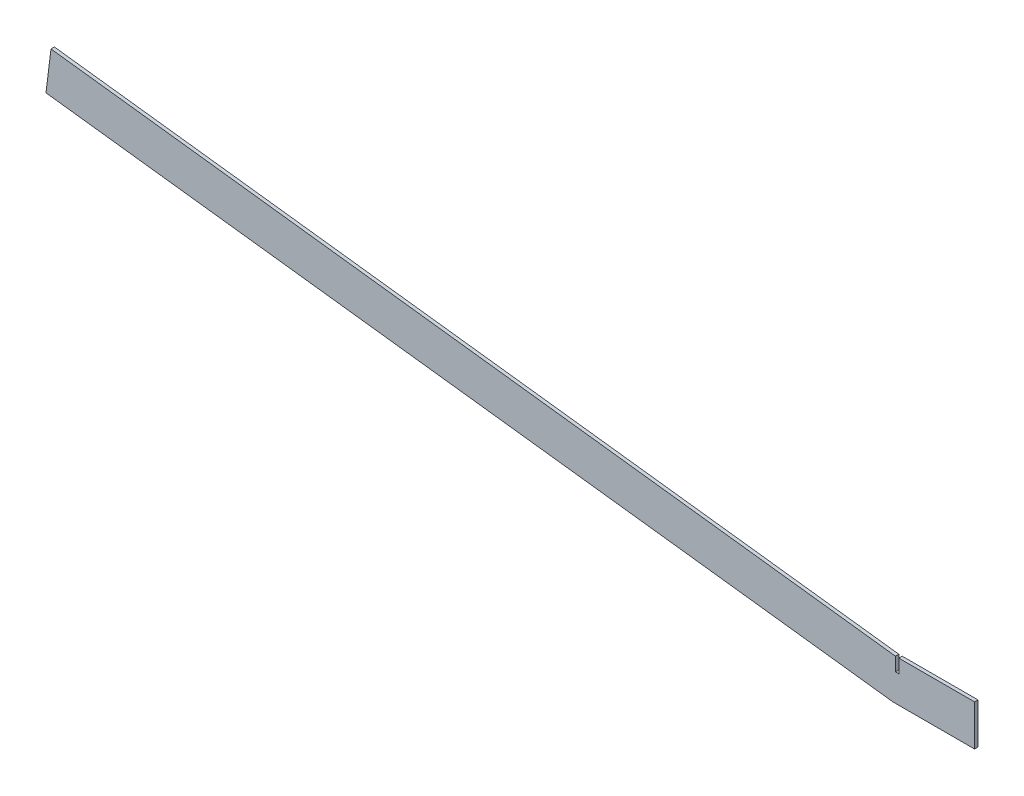
ISO-10303-21;
HEADER;
FILE_DESCRIPTION(('STEP AP214'),'2;1');
FILE_NAME('part.step','',(''),(''),'','','');
FILE_SCHEMA(('AUTOMOTIVE_DESIGN { 1 0 10303 214 1 1 1 1 }'));
ENDSEC;
DATA;
#1=APPLICATION_CONTEXT('core data for automotive mechanical design processes');
#2=APPLICATION_PROTOCOL_DEFINITION('international standard','automotive_design',2000,#1);
#3=PRODUCT_CONTEXT('',#1,'mechanical');
#4=PRODUCT('Part','Part','',(#3));
#5=PRODUCT_RELATED_PRODUCT_CATEGORY('part','',(#4));
#6=PRODUCT_DEFINITION_FORMATION('','',#4);
#7=PRODUCT_DEFINITION_CONTEXT('part definition',#1,'design');
#8=PRODUCT_DEFINITION('design','',#6,#7);
#9=PRODUCT_DEFINITION_SHAPE('','',#8);
#10=(LENGTH_UNIT() NAMED_UNIT(*) SI_UNIT(.MILLI.,.METRE.));
#11=(NAMED_UNIT(*) PLANE_ANGLE_UNIT() SI_UNIT($,.RADIAN.));
#12=(NAMED_UNIT(*) SI_UNIT($,.STERADIAN.) SOLID_ANGLE_UNIT());
#13=UNCERTAINTY_MEASURE_WITH_UNIT(LENGTH_MEASURE(1.E-05),#10,'distance_accuracy_value','');
#14=(GEOMETRIC_REPRESENTATION_CONTEXT(3) GLOBAL_UNCERTAINTY_ASSIGNED_CONTEXT((#13)) GLOBAL_UNIT_ASSIGNED_CONTEXT((#10,
#11,#12)) REPRESENTATION_CONTEXT('',''));
#15=CARTESIAN_POINT('',(0.,0.,0.));
#16=DIRECTION('',(0.,0.,1.));
#17=DIRECTION('',(1.,0.,0.));
#18=AXIS2_PLACEMENT_3D('',#15,#16,#17);
#19=CARTESIAN_POINT('',(5.50529582773423,0.,1.5875));
#20=DIRECTION('',(-1.,0.,0.));
#21=DIRECTION('',(0.,0.,1.));
#22=AXIS2_PLACEMENT_3D('',#19,#20,#21);
#23=PLANE('',#22);
#24=DIRECTION('',(0.,1.,0.));
#25=VECTOR('',#24,1.);
#26=CARTESIAN_POINT('',(5.50529582773423,0.,-1.5875));
#27=LINE('',#26,#25);
#28=CARTESIAN_POINT('',(5.50529582773423,25.4,-1.5875));
#29=VERTEX_POINT('',#28);
#30=CARTESIAN_POINT('',(5.50529582773423,38.1,-1.5875));
#31=VERTEX_POINT('',#30);
#32=EDGE_CURVE('E145',#29,#31,#27,.T.);
#33=ORIENTED_EDGE('',*,*,#32,.F.);
#34=DIRECTION('',(0.,0.,-1.));
#35=VECTOR('',#34,1.);
#36=CARTESIAN_POINT('',(5.50529582773423,25.4,1.5875));
#37=LINE('',#36,#35);
#38=CARTESIAN_POINT('',(5.50529582773423,25.4,1.5875));
#39=VERTEX_POINT('',#38);
#40=EDGE_CURVE('E11',#39,#29,#37,.T.);
#41=ORIENTED_EDGE('',*,*,#40,.F.);
#42=DIRECTION('',(0.,1.,0.));
#43=VECTOR('',#42,1.);
#44=CARTESIAN_POINT('',(5.50529582773423,0.,1.5875));
#45=LINE('',#44,#43);
#46=CARTESIAN_POINT('',(5.50529582773423,38.1,1.5875));
#47=VERTEX_POINT('',#46);
#48=EDGE_CURVE('E177',#39,#47,#45,.T.);
#49=ORIENTED_EDGE('',*,*,#48,.T.);
#50=DIRECTION('',(0.,0.,-1.));
#51=VECTOR('',#50,1.);
#52=CARTESIAN_POINT('',(5.50529582773423,38.1,1.5875));
#53=LINE('',#52,#51);
#54=EDGE_CURVE('E58',#47,#31,#53,.T.);
#55=ORIENTED_EDGE('',*,*,#54,.T.);
#56=EDGE_LOOP('',(#33,#41,#49,#55));
#57=FACE_BOUND('',#56,.T.);
#58=ADVANCED_FACE('F41',(#57),#23,.T.);
#59=CARTESIAN_POINT('',(0.,25.4,1.5875));
#60=DIRECTION('',(0.,1.,0.));
#61=DIRECTION('',(0.,0.,1.));
#62=AXIS2_PLACEMENT_3D('',#59,#60,#61);
#63=PLANE('',#62);
#64=DIRECTION('',(1.,0.,0.));
#65=VECTOR('',#64,1.);
#66=CARTESIAN_POINT('',(0.,25.4,-1.5875));
#67=LINE('',#66,#65);
#68=CARTESIAN_POINT('',(2.33029582773423,25.4,-1.5875));
#69=VERTEX_POINT('',#68);
#70=EDGE_CURVE('E148',#69,#29,#67,.T.);
#71=ORIENTED_EDGE('',*,*,#70,.F.);
#72=DIRECTION('',(0.,0.,-1.));
#73=VECTOR('',#72,1.);
#74=CARTESIAN_POINT('',(2.33029582773423,25.4,1.5875));
#75=LINE('',#74,#73);
#76=CARTESIAN_POINT('',(2.33029582773423,25.4,1.5875));
#77=VERTEX_POINT('',#76);
#78=EDGE_CURVE('E50',#77,#69,#75,.T.);
#79=ORIENTED_EDGE('',*,*,#78,.F.);
#80=DIRECTION('',(1.,0.,0.));
#81=VECTOR('',#80,1.);
#82=CARTESIAN_POINT('',(0.,25.4,1.5875));
#83=LINE('',#82,#81);
#84=EDGE_CURVE('E214',#77,#39,#83,.T.);
#85=ORIENTED_EDGE('',*,*,#84,.T.);
#86=ORIENTED_EDGE('',*,*,#40,.T.);
#87=EDGE_LOOP('',(#71,#79,#85,#86));
#88=FACE_BOUND('',#87,.T.);
#89=ADVANCED_FACE('F203',(#88),#63,.T.);
#90=CARTESIAN_POINT('',(2.33029582773423,0.,1.5875));
#91=DIRECTION('',(1.,0.,0.));
#92=DIRECTION('',(0.,1.,0.));
#93=AXIS2_PLACEMENT_3D('',#90,#91,#92);
#94=PLANE('',#93);
#95=DIRECTION('',(0.,-1.,0.));
#96=VECTOR('',#95,1.);
#97=CARTESIAN_POINT('',(2.33029582773423,0.,-1.5875));
#98=LINE('',#97,#96);
#99=CARTESIAN_POINT('',(2.33029582773423,38.1,-1.5875));
#100=VERTEX_POINT('',#99);
#101=EDGE_CURVE('E152',#100,#69,#98,.T.);
#102=ORIENTED_EDGE('',*,*,#101,.F.);
#103=DIRECTION('',(0.,0.,-1.));
#104=VECTOR('',#103,1.);
#105=CARTESIAN_POINT('',(2.33029582773423,38.1,1.5875));
#106=LINE('',#105,#104);
#107=CARTESIAN_POINT('',(2.33029582773423,38.1,1.5875));
#108=VERTEX_POINT('',#107);
#109=EDGE_CURVE('E190',#108,#100,#106,.T.);
#110=ORIENTED_EDGE('',*,*,#109,.F.);
#111=DIRECTION('',(0.,-1.,0.));
#112=VECTOR('',#111,1.);
#113=CARTESIAN_POINT('',(2.33029582773423,0.,1.5875));
#114=LINE('',#113,#112);
#115=EDGE_CURVE('E199',#108,#77,#114,.T.);
#116=ORIENTED_EDGE('',*,*,#115,.T.);
#117=ORIENTED_EDGE('',*,*,#78,.T.);
#118=EDGE_LOOP('',(#102,#110,#116,#117));
#119=FACE_BOUND('',#118,.T.);
#120=ADVANCED_FACE('F197',(#119),#94,.T.);
#121=CARTESIAN_POINT('',(4.64322198373613,37.8160083775344,1.5875));
#122=DIRECTION('',(0.121869343405148,0.992546151641322,0.));
#123=DIRECTION('',(-0.992546151641322,0.121869343405148,0.));
#124=AXIS2_PLACEMENT_3D('',#121,#122,#123);
#125=PLANE('',#124);
#126=DIRECTION('',(0.992546151641322,-0.121869343405148,0.));
#127=VECTOR('',#126,1.);
#128=CARTESIAN_POINT('',(4.64322198373613,37.8160083775344,-1.5875));
#129=LINE('',#128,#127);
#130=CARTESIAN_POINT('',(-785.101818548873,134.784506404577,-1.5875));
#131=VERTEX_POINT('',#130);
#132=EDGE_CURVE('E156',#131,#100,#129,.T.);
#133=ORIENTED_EDGE('',*,*,#132,.F.);
#134=DIRECTION('',(0.,0.,-1.));
#135=VECTOR('',#134,1.);
#136=CARTESIAN_POINT('',(-785.101818548873,134.784506404577,1.5875));
#137=LINE('',#136,#135);
#138=CARTESIAN_POINT('',(-785.101818548873,134.784506404577,1.5875));
#139=VERTEX_POINT('',#138);
#140=EDGE_CURVE('E187',#139,#131,#137,.T.);
#141=ORIENTED_EDGE('',*,*,#140,.F.);
#142=DIRECTION('',(0.992546151641322,-0.121869343405148,0.));
#143=VECTOR('',#142,1.);
#144=CARTESIAN_POINT('',(4.64322198373613,37.8160083775344,1.5875));
#145=LINE('',#144,#143);
#146=EDGE_CURVE('E212',#139,#108,#145,.T.);
#147=ORIENTED_EDGE('',*,*,#146,.T.);
#148=ORIENTED_EDGE('',*,*,#109,.T.);
#149=EDGE_LOOP('',(#133,#141,#147,#148));
#150=FACE_BOUND('',#149,.T.);
#151=ADVANCED_FACE('F209',(#150),#125,.T.);
#152=CARTESIAN_POINT('',(-789.745040532609,96.9684980270453,1.5875));
#153=DIRECTION('',(-0.992546151641322,0.12186934340515,0.));
#154=DIRECTION('',(-0.12186934340515,-0.992546151641322,0.));
#155=AXIS2_PLACEMENT_3D('',#152,#153,#154);
#156=PLANE('',#155);
#157=DIRECTION('',(0.12186934340515,0.992546151641322,0.));
#158=VECTOR('',#157,1.);
#159=CARTESIAN_POINT('',(-789.745040532609,96.9684980270453,-1.5875));
#160=LINE('',#159,#158);
#161=CARTESIAN_POINT('',(-789.745040532609,96.9684980270431,-1.5875));
#162=VERTEX_POINT('',#161);
#163=EDGE_CURVE('E160',#162,#131,#160,.T.);
#164=ORIENTED_EDGE('',*,*,#163,.F.);
#165=DIRECTION('',(0.,0.,-1.));
#166=VECTOR('',#165,1.);
#167=CARTESIAN_POINT('',(-789.745040532609,96.9684980270431,1.5875));
#168=LINE('',#167,#166);
#169=CARTESIAN_POINT('',(-789.745040532609,96.9684980270431,1.5875));
#170=VERTEX_POINT('',#169);
#171=EDGE_CURVE('E184',#170,#162,#168,.T.);
#172=ORIENTED_EDGE('',*,*,#171,.F.);
#173=DIRECTION('',(0.12186934340515,0.992546151641322,0.));
#174=VECTOR('',#173,1.);
#175=CARTESIAN_POINT('',(-789.745040532609,96.9684980270453,1.5875));
#176=LINE('',#175,#174);
#177=EDGE_CURVE('E219',#170,#139,#176,.T.);
#178=ORIENTED_EDGE('',*,*,#177,.T.);
#179=ORIENTED_EDGE('',*,*,#140,.T.);
#180=EDGE_LOOP('',(#164,#172,#178,#179));
#181=FACE_BOUND('',#180,.T.);
#182=ADVANCED_FACE('F250',(#181),#156,.T.);
#183=CARTESIAN_POINT('',(0.,0.,1.5875));
#184=DIRECTION('',(-0.121869343405148,-0.992546151641322,0.));
#185=DIRECTION('',(0.992546151641322,-0.121869343405148,0.));
#186=AXIS2_PLACEMENT_3D('',#183,#184,#185);
#187=PLANE('',#186);
#188=DIRECTION('',(-0.992546151641322,0.121869343405148,0.));
#189=VECTOR('',#188,1.);
#190=CARTESIAN_POINT('',(0.,0.,-1.5875));
#191=LINE('',#190,#189);
#192=CARTESIAN_POINT('',(0.,0.,-1.5875));
#193=VERTEX_POINT('',#192);
#194=EDGE_CURVE('E164',#193,#162,#191,.T.);
#195=ORIENTED_EDGE('',*,*,#194,.F.);
#196=DIRECTION('',(0.,0.,-1.));
#197=VECTOR('',#196,1.);
#198=CARTESIAN_POINT('',(0.,0.,1.5875));
#199=LINE('',#198,#197);
#200=CARTESIAN_POINT('',(0.,0.,1.5875));
#201=VERTEX_POINT('',#200);
#202=EDGE_CURVE('E124',#201,#193,#199,.T.);
#203=ORIENTED_EDGE('',*,*,#202,.F.);
#204=DIRECTION('',(-0.992546151641322,0.121869343405148,0.));
#205=VECTOR('',#204,1.);
#206=CARTESIAN_POINT('',(0.,0.,1.5875));
#207=LINE('',#206,#205);
#208=EDGE_CURVE('E134',#201,#170,#207,.T.);
#209=ORIENTED_EDGE('',*,*,#208,.T.);
#210=ORIENTED_EDGE('',*,*,#171,.T.);
#211=EDGE_LOOP('',(#195,#203,#209,#210));
#212=FACE_BOUND('',#211,.T.);
#213=ADVANCED_FACE('F228',(#212),#187,.T.);
#214=CARTESIAN_POINT('',(0.,0.,1.5875));
#215=DIRECTION('',(0.,-1.,0.));
#216=DIRECTION('',(1.,0.,0.));
#217=AXIS2_PLACEMENT_3D('',#214,#215,#216);
#218=PLANE('',#217);
#219=DIRECTION('',(-1.,0.,0.));
#220=VECTOR('',#219,1.);
#221=CARTESIAN_POINT('',(0.,0.,-1.5875));
#222=LINE('',#221,#220);
#223=CARTESIAN_POINT('',(76.2,0.,-1.5875));
#224=VERTEX_POINT('',#223);
#225=EDGE_CURVE('E119',#224,#193,#222,.T.);
#226=ORIENTED_EDGE('',*,*,#225,.F.);
#227=DIRECTION('',(0.,0.,-1.));
#228=VECTOR('',#227,1.);
#229=CARTESIAN_POINT('',(76.2,0.,1.5875));
#230=LINE('',#229,#228);
#231=CARTESIAN_POINT('',(76.2,0.,1.5875));
#232=VERTEX_POINT('',#231);
#233=EDGE_CURVE('E114',#232,#224,#230,.T.);
#234=ORIENTED_EDGE('',*,*,#233,.F.);
#235=DIRECTION('',(-1.,0.,0.));
#236=VECTOR('',#235,1.);
#237=CARTESIAN_POINT('',(0.,0.,1.5875));
#238=LINE('',#237,#236);
#239=EDGE_CURVE('E117',#232,#201,#238,.T.);
#240=ORIENTED_EDGE('',*,*,#239,.T.);
#241=ORIENTED_EDGE('',*,*,#202,.T.);
#242=EDGE_LOOP('',(#226,#234,#240,#241));
#243=FACE_BOUND('',#242,.T.);
#244=ADVANCED_FACE('F116',(#243),#218,.T.);
#245=CARTESIAN_POINT('',(76.2,4.71844785465692E-13,1.5875));
#246=DIRECTION('',(1.,0.,0.));
#247=DIRECTION('',(0.,1.,0.));
#248=AXIS2_PLACEMENT_3D('',#245,#246,#247);
#249=PLANE('',#248);
#250=DIRECTION('',(0.,-1.,0.));
#251=VECTOR('',#250,1.);
#252=CARTESIAN_POINT('',(76.2,4.71844785465692E-13,-1.5875));
#253=LINE('',#252,#251);
#254=CARTESIAN_POINT('',(76.1999999999998,38.1,-1.5875));
#255=VERTEX_POINT('',#254);
#256=EDGE_CURVE('E170',#255,#224,#253,.T.);
#257=ORIENTED_EDGE('',*,*,#256,.F.);
#258=DIRECTION('',(0.,0.,-1.));
#259=VECTOR('',#258,1.);
#260=CARTESIAN_POINT('',(76.1999999999998,38.1,1.5875));
#261=LINE('',#260,#259);
#262=CARTESIAN_POINT('',(76.1999999999998,38.1,1.5875));
#263=VERTEX_POINT('',#262);
#264=EDGE_CURVE('E86',#263,#255,#261,.T.);
#265=ORIENTED_EDGE('',*,*,#264,.F.);
#266=DIRECTION('',(0.,-1.,0.));
#267=VECTOR('',#266,1.);
#268=CARTESIAN_POINT('',(76.2,4.71844785465692E-13,1.5875));
#269=LINE('',#268,#267);
#270=EDGE_CURVE('E131',#263,#232,#269,.T.);
#271=ORIENTED_EDGE('',*,*,#270,.T.);
#272=ORIENTED_EDGE('',*,*,#233,.T.);
#273=EDGE_LOOP('',(#257,#265,#271,#272));
#274=FACE_BOUND('',#273,.T.);
#275=ADVANCED_FACE('F137',(#274),#249,.T.);
#276=CARTESIAN_POINT('',(0.,38.1,1.5875));
#277=DIRECTION('',(0.,1.,0.));
#278=DIRECTION('',(0.,0.,1.));
#279=AXIS2_PLACEMENT_3D('',#276,#277,#278);
#280=PLANE('',#279);
#281=DIRECTION('',(1.,0.,0.));
#282=VECTOR('',#281,1.);
#283=CARTESIAN_POINT('',(0.,38.1,-1.5875));
#284=LINE('',#283,#282);
#285=EDGE_CURVE('E173',#31,#255,#284,.T.);
#286=ORIENTED_EDGE('',*,*,#285,.F.);
#287=ORIENTED_EDGE('',*,*,#54,.F.);
#288=DIRECTION('',(1.,0.,0.));
#289=VECTOR('',#288,1.);
#290=CARTESIAN_POINT('',(0.,38.1,1.5875));
#291=LINE('',#290,#289);
#292=EDGE_CURVE('E139',#47,#263,#291,.T.);
#293=ORIENTED_EDGE('',*,*,#292,.T.);
#294=ORIENTED_EDGE('',*,*,#264,.T.);
#295=EDGE_LOOP('',(#286,#287,#293,#294));
#296=FACE_BOUND('',#295,.T.);
#297=ADVANCED_FACE('F229',(#296),#280,.T.);
#298=CARTESIAN_POINT('',(0.,0.,1.5875));
#299=DIRECTION('',(0.,0.,1.));
#300=DIRECTION('',(1.,0.,0.));
#301=AXIS2_PLACEMENT_3D('',#298,#299,#300);
#302=PLANE('',#301);
#303=ORIENTED_EDGE('',*,*,#48,.F.);
#304=ORIENTED_EDGE('',*,*,#84,.F.);
#305=ORIENTED_EDGE('',*,*,#115,.F.);
#306=ORIENTED_EDGE('',*,*,#146,.F.);
#307=ORIENTED_EDGE('',*,*,#177,.F.);
#308=ORIENTED_EDGE('',*,*,#208,.F.);
#309=ORIENTED_EDGE('',*,*,#239,.F.);
#310=ORIENTED_EDGE('',*,*,#270,.F.);
#311=ORIENTED_EDGE('',*,*,#292,.F.);
#312=EDGE_LOOP('',(#303,#304,#305,#306,#307,#308,#309,#310,#311));
#313=FACE_BOUND('',#312,.T.);
#314=ADVANCED_FACE('F129',(#313),#302,.T.);
#315=CARTESIAN_POINT('',(0.,0.,-1.5875));
#316=DIRECTION('',(0.,0.,1.));
#317=DIRECTION('',(1.,0.,0.));
#318=AXIS2_PLACEMENT_3D('',#315,#316,#317);
#319=PLANE('',#318);
#320=ORIENTED_EDGE('',*,*,#32,.T.);
#321=ORIENTED_EDGE('',*,*,#285,.T.);
#322=ORIENTED_EDGE('',*,*,#256,.T.);
#323=ORIENTED_EDGE('',*,*,#225,.T.);
#324=ORIENTED_EDGE('',*,*,#194,.T.);
#325=ORIENTED_EDGE('',*,*,#163,.T.);
#326=ORIENTED_EDGE('',*,*,#132,.T.);
#327=ORIENTED_EDGE('',*,*,#101,.T.);
#328=ORIENTED_EDGE('',*,*,#70,.T.);
#329=EDGE_LOOP('',(#320,#321,#322,#323,#324,#325,#326,#327,#328));
#330=FACE_BOUND('',#329,.T.);
#331=ADVANCED_FACE('F205',(#330),#319,.F.);
#332=CLOSED_SHELL('',(#58,#89,#120,#151,#182,#213,#244,#275,#297,#314,#331));
#333=MANIFOLD_SOLID_BREP('B2',#332);
#334=ADVANCED_BREP_SHAPE_REPRESENTATION('',(#18,#333),#14);
#335=SHAPE_DEFINITION_REPRESENTATION(#9,#334);
ENDSEC;
END-ISO-10303-21;
